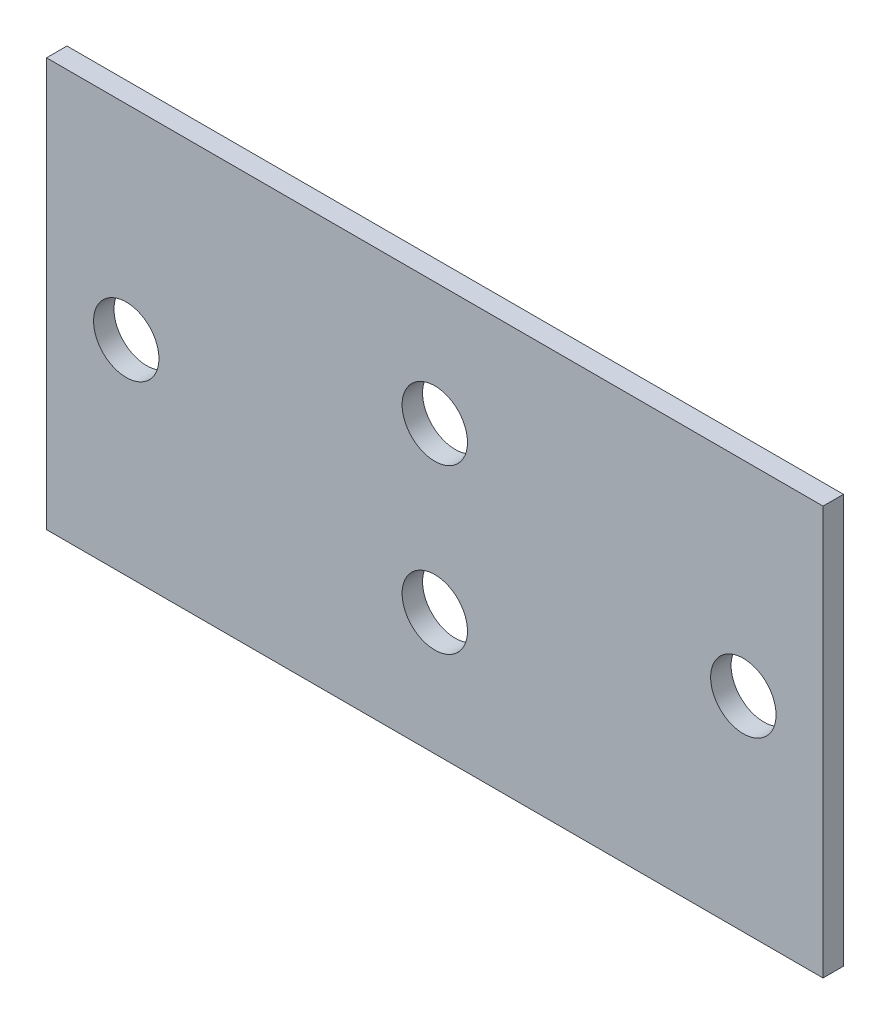
ISO-10303-21;
HEADER;
FILE_DESCRIPTION(('STEP AP214'),'2;1');
FILE_NAME('part.step','',(''),(''),'','','');
FILE_SCHEMA(('AUTOMOTIVE_DESIGN { 1 0 10303 214 1 1 1 1 }'));
ENDSEC;
DATA;
#1=APPLICATION_CONTEXT('core data for automotive mechanical design processes');
#2=APPLICATION_PROTOCOL_DEFINITION('international standard','automotive_design',2000,#1);
#3=PRODUCT_CONTEXT('',#1,'mechanical');
#4=PRODUCT('Part','Part','',(#3));
#5=PRODUCT_RELATED_PRODUCT_CATEGORY('part','',(#4));
#6=PRODUCT_DEFINITION_FORMATION('','',#4);
#7=PRODUCT_DEFINITION_CONTEXT('part definition',#1,'design');
#8=PRODUCT_DEFINITION('design','',#6,#7);
#9=PRODUCT_DEFINITION_SHAPE('','',#8);
#10=(LENGTH_UNIT() NAMED_UNIT(*) SI_UNIT(.MILLI.,.METRE.));
#11=(NAMED_UNIT(*) PLANE_ANGLE_UNIT() SI_UNIT($,.RADIAN.));
#12=(NAMED_UNIT(*) SI_UNIT($,.STERADIAN.) SOLID_ANGLE_UNIT());
#13=UNCERTAINTY_MEASURE_WITH_UNIT(LENGTH_MEASURE(1.E-05),#10,'distance_accuracy_value','');
#14=(GEOMETRIC_REPRESENTATION_CONTEXT(3) GLOBAL_UNCERTAINTY_ASSIGNED_CONTEXT((#13)) GLOBAL_UNIT_ASSIGNED_CONTEXT((#10,
#11,#12)) REPRESENTATION_CONTEXT('',''));
#15=CARTESIAN_POINT('',(0.,0.,0.));
#16=DIRECTION('',(0.,0.,1.));
#17=DIRECTION('',(1.,0.,0.));
#18=AXIS2_PLACEMENT_3D('',#15,#16,#17);
#19=CARTESIAN_POINT('',(0.,0.,0.));
#20=DIRECTION('',(0.,0.,1.));
#21=DIRECTION('',(1.,0.,0.));
#22=AXIS2_PLACEMENT_3D('',#19,#20,#21);
#23=PLANE('',#22);
#24=CARTESIAN_POINT('',(15.1,0.,0.));
#25=DIRECTION('',(0.,0.,1.));
#26=DIRECTION('',(1.,0.,0.));
#27=AXIS2_PLACEMENT_3D('',#24,#25,#26);
#28=CIRCLE('',#27,1.6);
#29=CARTESIAN_POINT('',(16.7,0.,0.));
#30=VERTEX_POINT('',#29);
#31=EDGE_CURVE('E89',#30,#30,#28,.T.);
#32=ORIENTED_EDGE('',*,*,#31,.T.);
#33=EDGE_LOOP('',(#32));
#34=FACE_BOUND('',#33,.T.);
#35=CARTESIAN_POINT('',(-15.1,0.,0.));
#36=DIRECTION('',(0.,0.,1.));
#37=DIRECTION('',(1.,0.,0.));
#38=AXIS2_PLACEMENT_3D('',#35,#36,#37);
#39=CIRCLE('',#38,1.6);
#40=CARTESIAN_POINT('',(-13.5,0.,0.));
#41=VERTEX_POINT('',#40);
#42=EDGE_CURVE('E93',#41,#41,#39,.T.);
#43=ORIENTED_EDGE('',*,*,#42,.T.);
#44=EDGE_LOOP('',(#43));
#45=FACE_BOUND('',#44,.T.);
#46=CARTESIAN_POINT('',(0.,-3.99999999999999,0.));
#47=DIRECTION('',(0.,0.,1.));
#48=DIRECTION('',(1.,0.,0.));
#49=AXIS2_PLACEMENT_3D('',#46,#47,#48);
#50=CIRCLE('',#49,1.6);
#51=CARTESIAN_POINT('',(1.6,-3.99999999999999,0.));
#52=VERTEX_POINT('',#51);
#53=EDGE_CURVE('E95',#52,#52,#50,.T.);
#54=ORIENTED_EDGE('',*,*,#53,.T.);
#55=EDGE_LOOP('',(#54));
#56=FACE_BOUND('',#55,.T.);
#57=CARTESIAN_POINT('',(0.,3.99999999999999,0.));
#58=DIRECTION('',(0.,0.,1.));
#59=DIRECTION('',(1.,0.,0.));
#60=AXIS2_PLACEMENT_3D('',#57,#58,#59);
#61=CIRCLE('',#60,1.6);
#62=CARTESIAN_POINT('',(1.6,3.99999999999999,0.));
#63=VERTEX_POINT('',#62);
#64=EDGE_CURVE('E19',#63,#63,#61,.T.);
#65=ORIENTED_EDGE('',*,*,#64,.T.);
#66=EDGE_LOOP('',(#65));
#67=FACE_BOUND('',#66,.T.);
#68=DIRECTION('',(0.,1.,0.));
#69=VECTOR('',#68,1.);
#70=CARTESIAN_POINT('',(19.,10.,0.));
#71=LINE('',#70,#69);
#72=CARTESIAN_POINT('',(19.,-9.99999999999999,0.));
#73=VERTEX_POINT('',#72);
#74=CARTESIAN_POINT('',(19.,10.,0.));
#75=VERTEX_POINT('',#74);
#76=EDGE_CURVE('E59',#73,#75,#71,.T.);
#77=ORIENTED_EDGE('',*,*,#76,.F.);
#78=DIRECTION('',(1.,0.,0.));
#79=VECTOR('',#78,1.);
#80=CARTESIAN_POINT('',(19.,-9.99999999999999,0.));
#81=LINE('',#80,#79);
#82=CARTESIAN_POINT('',(-19.,-10.,0.));
#83=VERTEX_POINT('',#82);
#84=EDGE_CURVE('E102',#83,#73,#81,.T.);
#85=ORIENTED_EDGE('',*,*,#84,.F.);
#86=DIRECTION('',(0.,-1.,0.));
#87=VECTOR('',#86,1.);
#88=CARTESIAN_POINT('',(-19.,-10.,0.));
#89=LINE('',#88,#87);
#90=CARTESIAN_POINT('',(-19.,10.,0.));
#91=VERTEX_POINT('',#90);
#92=EDGE_CURVE('E69',#91,#83,#89,.T.);
#93=ORIENTED_EDGE('',*,*,#92,.F.);
#94=DIRECTION('',(-1.,0.,0.));
#95=VECTOR('',#94,1.);
#96=CARTESIAN_POINT('',(-19.,10.,0.));
#97=LINE('',#96,#95);
#98=EDGE_CURVE('E54',#75,#91,#97,.T.);
#99=ORIENTED_EDGE('',*,*,#98,.F.);
#100=EDGE_LOOP('',(#77,#85,#93,#99));
#101=FACE_BOUND('',#100,.T.);
#102=ADVANCED_FACE('F16',(#34,#45,#56,#67,#101),#23,.F.);
#103=CARTESIAN_POINT('',(19.,10.,0.));
#104=DIRECTION('',(1.,0.,0.));
#105=DIRECTION('',(0.,0.,-1.));
#106=AXIS2_PLACEMENT_3D('',#103,#104,#105);
#107=PLANE('',#106);
#108=ORIENTED_EDGE('',*,*,#76,.T.);
#109=DIRECTION('',(0.,0.,1.));
#110=VECTOR('',#109,1.);
#111=CARTESIAN_POINT('',(19.,10.,0.));
#112=LINE('',#111,#110);
#113=CARTESIAN_POINT('',(19.,10.,1.));
#114=VERTEX_POINT('',#113);
#115=EDGE_CURVE('E61',#114,#75,#112,.F.);
#116=ORIENTED_EDGE('',*,*,#115,.F.);
#117=DIRECTION('',(0.,1.,0.));
#118=VECTOR('',#117,1.);
#119=CARTESIAN_POINT('',(19.,0.,1.));
#120=LINE('',#119,#118);
#121=CARTESIAN_POINT('',(19.,-9.99999999999999,1.));
#122=VERTEX_POINT('',#121);
#123=EDGE_CURVE('E92',#122,#114,#120,.T.);
#124=ORIENTED_EDGE('',*,*,#123,.F.);
#125=DIRECTION('',(0.,0.,1.));
#126=VECTOR('',#125,1.);
#127=CARTESIAN_POINT('',(19.,-9.99999999999999,0.));
#128=LINE('',#127,#126);
#129=EDGE_CURVE('E64',#73,#122,#128,.T.);
#130=ORIENTED_EDGE('',*,*,#129,.F.);
#131=EDGE_LOOP('',(#108,#116,#124,#130));
#132=FACE_BOUND('',#131,.T.);
#133=ADVANCED_FACE('F60',(#132),#107,.T.);
#134=CARTESIAN_POINT('',(-19.,10.,0.));
#135=DIRECTION('',(0.,1.,0.));
#136=DIRECTION('',(-1.,0.,0.));
#137=AXIS2_PLACEMENT_3D('',#134,#135,#136);
#138=PLANE('',#137);
#139=ORIENTED_EDGE('',*,*,#98,.T.);
#140=DIRECTION('',(0.,0.,1.));
#141=VECTOR('',#140,1.);
#142=CARTESIAN_POINT('',(-19.,10.,0.));
#143=LINE('',#142,#141);
#144=CARTESIAN_POINT('',(-19.,10.,1.));
#145=VERTEX_POINT('',#144);
#146=EDGE_CURVE('E71',#145,#91,#143,.F.);
#147=ORIENTED_EDGE('',*,*,#146,.F.);
#148=DIRECTION('',(1.,0.,0.));
#149=VECTOR('',#148,1.);
#150=CARTESIAN_POINT('',(0.,10.,1.));
#151=LINE('',#150,#149);
#152=EDGE_CURVE('E75',#114,#145,#151,.F.);
#153=ORIENTED_EDGE('',*,*,#152,.F.);
#154=ORIENTED_EDGE('',*,*,#115,.T.);
#155=EDGE_LOOP('',(#139,#147,#153,#154));
#156=FACE_BOUND('',#155,.T.);
#157=ADVANCED_FACE('F73',(#156),#138,.T.);
#158=CARTESIAN_POINT('',(-19.,-10.,0.));
#159=DIRECTION('',(-1.,0.,0.));
#160=DIRECTION('',(0.,-1.,0.));
#161=AXIS2_PLACEMENT_3D('',#158,#159,#160);
#162=PLANE('',#161);
#163=ORIENTED_EDGE('',*,*,#92,.T.);
#164=DIRECTION('',(0.,0.,1.));
#165=VECTOR('',#164,1.);
#166=CARTESIAN_POINT('',(-19.,-9.99999999999999,0.));
#167=LINE('',#166,#165);
#168=CARTESIAN_POINT('',(-19.,-10.,1.));
#169=VERTEX_POINT('',#168);
#170=EDGE_CURVE('E34',#169,#83,#167,.F.);
#171=ORIENTED_EDGE('',*,*,#170,.F.);
#172=DIRECTION('',(0.,1.,0.));
#173=VECTOR('',#172,1.);
#174=CARTESIAN_POINT('',(-19.,0.,1.));
#175=LINE('',#174,#173);
#176=EDGE_CURVE('E113',#145,#169,#175,.F.);
#177=ORIENTED_EDGE('',*,*,#176,.F.);
#178=ORIENTED_EDGE('',*,*,#146,.T.);
#179=EDGE_LOOP('',(#163,#171,#177,#178));
#180=FACE_BOUND('',#179,.T.);
#181=ADVANCED_FACE('F111',(#180),#162,.T.);
#182=CARTESIAN_POINT('',(19.,-9.99999999999999,0.));
#183=DIRECTION('',(0.,-1.,0.));
#184=DIRECTION('',(1.,0.,0.));
#185=AXIS2_PLACEMENT_3D('',#182,#183,#184);
#186=PLANE('',#185);
#187=ORIENTED_EDGE('',*,*,#84,.T.);
#188=ORIENTED_EDGE('',*,*,#129,.T.);
#189=DIRECTION('',(1.,0.,0.));
#190=VECTOR('',#189,1.);
#191=CARTESIAN_POINT('',(0.,-10.,1.));
#192=LINE('',#191,#190);
#193=EDGE_CURVE('E88',#169,#122,#192,.T.);
#194=ORIENTED_EDGE('',*,*,#193,.F.);
#195=ORIENTED_EDGE('',*,*,#170,.T.);
#196=EDGE_LOOP('',(#187,#188,#194,#195));
#197=FACE_BOUND('',#196,.T.);
#198=ADVANCED_FACE('F118',(#197),#186,.T.);
#199=CARTESIAN_POINT('',(0.,3.99999999999999,0.));
#200=DIRECTION('',(0.,0.,1.));
#201=DIRECTION('',(1.,0.,0.));
#202=AXIS2_PLACEMENT_3D('',#199,#200,#201);
#203=CYLINDRICAL_SURFACE('',#202,1.6);
#204=CARTESIAN_POINT('',(0.,3.99999999999999,1.));
#205=DIRECTION('',(0.,0.,1.));
#206=DIRECTION('',(1.,0.,0.));
#207=AXIS2_PLACEMENT_3D('',#204,#205,#206);
#208=CIRCLE('',#207,1.6);
#209=CARTESIAN_POINT('',(1.6,3.99999999999999,1.));
#210=VERTEX_POINT('',#209);
#211=EDGE_CURVE('E85',#210,#210,#208,.F.);
#212=ORIENTED_EDGE('',*,*,#211,.F.);
#213=EDGE_LOOP('',(#212));
#214=FACE_BOUND('',#213,.T.);
#215=ORIENTED_EDGE('',*,*,#64,.F.);
#216=EDGE_LOOP('',(#215));
#217=FACE_BOUND('',#216,.T.);
#218=ADVANCED_FACE('F120',(#214,#217),#203,.F.);
#219=CARTESIAN_POINT('',(0.,-3.99999999999999,0.));
#220=DIRECTION('',(0.,0.,1.));
#221=DIRECTION('',(1.,0.,0.));
#222=AXIS2_PLACEMENT_3D('',#219,#220,#221);
#223=CYLINDRICAL_SURFACE('',#222,1.6);
#224=CARTESIAN_POINT('',(0.,-3.99999999999999,1.));
#225=DIRECTION('',(0.,0.,1.));
#226=DIRECTION('',(1.,0.,0.));
#227=AXIS2_PLACEMENT_3D('',#224,#225,#226);
#228=CIRCLE('',#227,1.6);
#229=CARTESIAN_POINT('',(1.6,-3.99999999999999,1.));
#230=VERTEX_POINT('',#229);
#231=EDGE_CURVE('E82',#230,#230,#228,.F.);
#232=ORIENTED_EDGE('',*,*,#231,.F.);
#233=EDGE_LOOP('',(#232));
#234=FACE_BOUND('',#233,.T.);
#235=ORIENTED_EDGE('',*,*,#53,.F.);
#236=EDGE_LOOP('',(#235));
#237=FACE_BOUND('',#236,.T.);
#238=ADVANCED_FACE('F127',(#234,#237),#223,.F.);
#239=CARTESIAN_POINT('',(-15.1,0.,0.));
#240=DIRECTION('',(0.,0.,1.));
#241=DIRECTION('',(1.,0.,0.));
#242=AXIS2_PLACEMENT_3D('',#239,#240,#241);
#243=CYLINDRICAL_SURFACE('',#242,1.6);
#244=CARTESIAN_POINT('',(-15.1,0.,1.));
#245=DIRECTION('',(0.,0.,1.));
#246=DIRECTION('',(1.,0.,0.));
#247=AXIS2_PLACEMENT_3D('',#244,#245,#246);
#248=CIRCLE('',#247,1.6);
#249=CARTESIAN_POINT('',(-13.5,0.,1.));
#250=VERTEX_POINT('',#249);
#251=EDGE_CURVE('E25',#250,#250,#248,.F.);
#252=ORIENTED_EDGE('',*,*,#251,.F.);
#253=EDGE_LOOP('',(#252));
#254=FACE_BOUND('',#253,.T.);
#255=ORIENTED_EDGE('',*,*,#42,.F.);
#256=EDGE_LOOP('',(#255));
#257=FACE_BOUND('',#256,.T.);
#258=ADVANCED_FACE('F138',(#254,#257),#243,.F.);
#259=CARTESIAN_POINT('',(15.1,0.,0.));
#260=DIRECTION('',(0.,0.,1.));
#261=DIRECTION('',(1.,0.,0.));
#262=AXIS2_PLACEMENT_3D('',#259,#260,#261);
#263=CYLINDRICAL_SURFACE('',#262,1.6);
#264=CARTESIAN_POINT('',(15.1,0.,1.));
#265=DIRECTION('',(0.,0.,1.));
#266=DIRECTION('',(1.,0.,0.));
#267=AXIS2_PLACEMENT_3D('',#264,#265,#266);
#268=CIRCLE('',#267,1.6);
#269=CARTESIAN_POINT('',(16.7,0.,1.));
#270=VERTEX_POINT('',#269);
#271=EDGE_CURVE('E11',#270,#270,#268,.F.);
#272=ORIENTED_EDGE('',*,*,#271,.F.);
#273=EDGE_LOOP('',(#272));
#274=FACE_BOUND('',#273,.T.);
#275=ORIENTED_EDGE('',*,*,#31,.F.);
#276=EDGE_LOOP('',(#275));
#277=FACE_BOUND('',#276,.T.);
#278=ADVANCED_FACE('F132',(#274,#277),#263,.F.);
#279=CARTESIAN_POINT('',(0.,0.,1.));
#280=DIRECTION('',(0.,0.,1.));
#281=DIRECTION('',(1.,0.,0.));
#282=AXIS2_PLACEMENT_3D('',#279,#280,#281);
#283=PLANE('',#282);
#284=ORIENTED_EDGE('',*,*,#271,.T.);
#285=EDGE_LOOP('',(#284));
#286=FACE_BOUND('',#285,.T.);
#287=ORIENTED_EDGE('',*,*,#251,.T.);
#288=EDGE_LOOP('',(#287));
#289=FACE_BOUND('',#288,.T.);
#290=ORIENTED_EDGE('',*,*,#231,.T.);
#291=EDGE_LOOP('',(#290));
#292=FACE_BOUND('',#291,.T.);
#293=ORIENTED_EDGE('',*,*,#211,.T.);
#294=EDGE_LOOP('',(#293));
#295=FACE_BOUND('',#294,.T.);
#296=ORIENTED_EDGE('',*,*,#176,.T.);
#297=ORIENTED_EDGE('',*,*,#193,.T.);
#298=ORIENTED_EDGE('',*,*,#123,.T.);
#299=ORIENTED_EDGE('',*,*,#152,.T.);
#300=EDGE_LOOP('',(#296,#297,#298,#299));
#301=FACE_BOUND('',#300,.T.);
#302=ADVANCED_FACE('F116',(#286,#289,#292,#295,#301),#283,.T.);
#303=CLOSED_SHELL('',(#102,#133,#157,#181,#198,#218,#238,#258,#278,#302));
#304=MANIFOLD_SOLID_BREP('B1',#303);
#305=ADVANCED_BREP_SHAPE_REPRESENTATION('',(#18,#304),#14);
#306=SHAPE_DEFINITION_REPRESENTATION(#9,#305);
ENDSEC;
END-ISO-10303-21;
